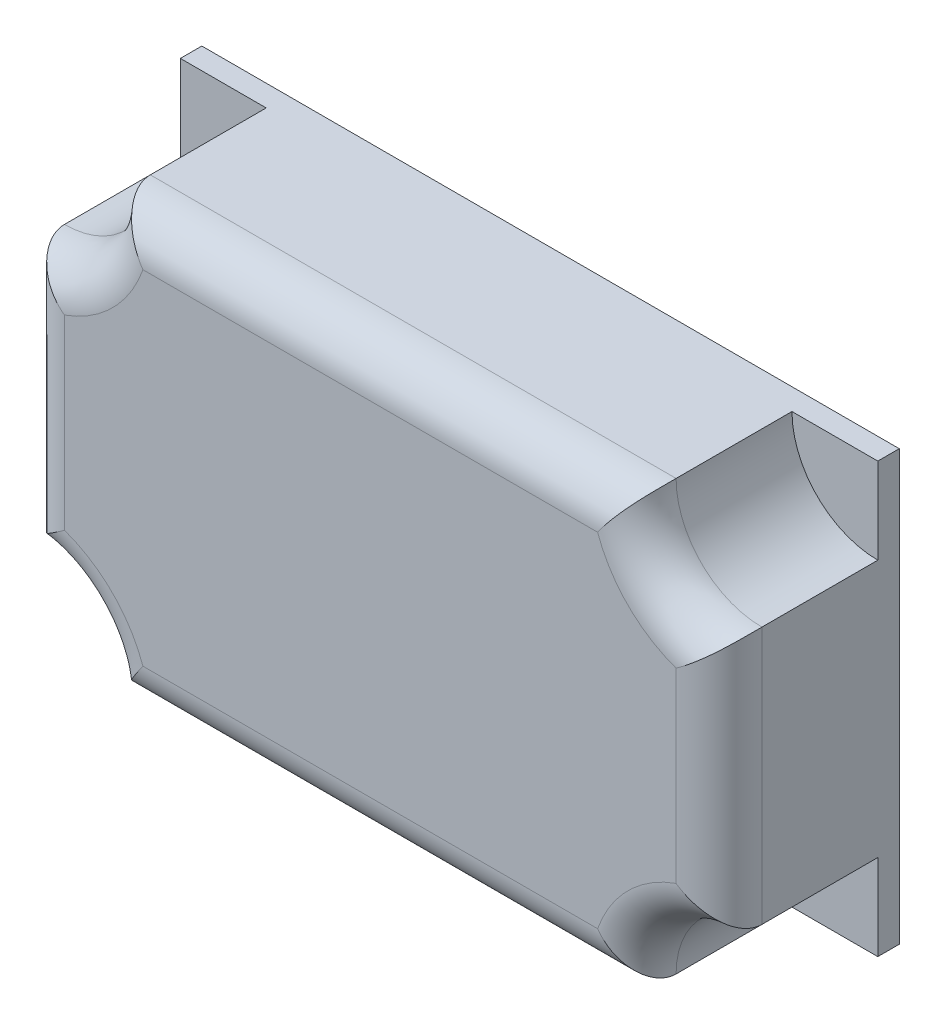
ISO-10303-21;
HEADER;
FILE_DESCRIPTION(('STEP AP214'),'2;1');
FILE_NAME('part.step','',(''),(''),'','','');
FILE_SCHEMA(('AUTOMOTIVE_DESIGN { 1 0 10303 214 1 1 1 1 }'));
ENDSEC;
DATA;
#1=APPLICATION_CONTEXT('core data for automotive mechanical design processes');
#2=APPLICATION_PROTOCOL_DEFINITION('international standard','automotive_design',2000,#1);
#3=PRODUCT_CONTEXT('',#1,'mechanical');
#4=PRODUCT('Part','Part','',(#3));
#5=PRODUCT_RELATED_PRODUCT_CATEGORY('part','',(#4));
#6=PRODUCT_DEFINITION_FORMATION('','',#4);
#7=PRODUCT_DEFINITION_CONTEXT('part definition',#1,'design');
#8=PRODUCT_DEFINITION('design','',#6,#7);
#9=PRODUCT_DEFINITION_SHAPE('','',#8);
#10=(LENGTH_UNIT() NAMED_UNIT(*) SI_UNIT(.MILLI.,.METRE.));
#11=(NAMED_UNIT(*) PLANE_ANGLE_UNIT() SI_UNIT($,.RADIAN.));
#12=(NAMED_UNIT(*) SI_UNIT($,.STERADIAN.) SOLID_ANGLE_UNIT());
#13=UNCERTAINTY_MEASURE_WITH_UNIT(LENGTH_MEASURE(1.E-05),#10,'distance_accuracy_value','');
#14=(GEOMETRIC_REPRESENTATION_CONTEXT(3) GLOBAL_UNCERTAINTY_ASSIGNED_CONTEXT((#13)) GLOBAL_UNIT_ASSIGNED_CONTEXT((#10,
#11,#12)) REPRESENTATION_CONTEXT('',''));
#15=CARTESIAN_POINT('',(0.,0.,0.));
#16=DIRECTION('',(0.,0.,1.));
#17=DIRECTION('',(1.,0.,0.));
#18=AXIS2_PLACEMENT_3D('',#15,#16,#17);
#19=CARTESIAN_POINT('',(27.841647561072,-18.1952723535457,14.8));
#20=DIRECTION('',(0.,0.,-1.));
#21=DIRECTION('',(-1.,0.,0.));
#22=AXIS2_PLACEMENT_3D('',#19,#20,#21);
#23=CYLINDRICAL_SURFACE('',#22,8.);
#24=DIRECTION('',(0.,0.,-1.));
#25=VECTOR('',#24,1.);
#26=CARTESIAN_POINT('',(27.841647561072,-10.1952723535457,14.8));
#27=LINE('',#26,#25);
#28=CARTESIAN_POINT('',(27.841647561072,-10.1952723535457,10.8));
#29=VERTEX_POINT('',#28);
#30=CARTESIAN_POINT('',(27.841647561072,-10.1952723535457,0.));
#31=VERTEX_POINT('',#30);
#32=EDGE_CURVE('E236',#29,#31,#27,.T.);
#33=ORIENTED_EDGE('',*,*,#32,.F.);
#34=CARTESIAN_POINT('',(27.841647561072,-18.1952723535457,10.8));
#35=DIRECTION('',(0.,0.,1.));
#36=DIRECTION('',(1.,0.,0.));
#37=AXIS2_PLACEMENT_3D('',#34,#35,#36);
#38=CIRCLE('',#37,8.);
#39=CARTESIAN_POINT('',(19.841647561072,-18.1952723535457,10.8));
#40=VERTEX_POINT('',#39);
#41=EDGE_CURVE('E11',#29,#40,#38,.T.);
#42=ORIENTED_EDGE('',*,*,#41,.T.);
#43=DIRECTION('',(0.,0.,-1.));
#44=VECTOR('',#43,1.);
#45=CARTESIAN_POINT('',(19.841647561072,-18.1952723535457,14.8));
#46=LINE('',#45,#44);
#47=CARTESIAN_POINT('',(19.841647561072,-18.1952723535457,0.));
#48=VERTEX_POINT('',#47);
#49=EDGE_CURVE('E222',#40,#48,#46,.T.);
#50=ORIENTED_EDGE('',*,*,#49,.T.);
#51=CARTESIAN_POINT('',(27.841647561072,-18.1952723535457,0.));
#52=DIRECTION('',(0.,0.,1.));
#53=DIRECTION('',(1.,0.,0.));
#54=AXIS2_PLACEMENT_3D('',#51,#52,#53);
#55=CIRCLE('',#54,8.);
#56=EDGE_CURVE('E206',#31,#48,#55,.T.);
#57=ORIENTED_EDGE('',*,*,#56,.F.);
#58=EDGE_LOOP('',(#33,#42,#50,#57));
#59=FACE_BOUND('',#58,.T.);
#60=ADVANCED_FACE('F38',(#59),#23,.F.);
#61=CARTESIAN_POINT('',(27.841647561072,0.,14.8));
#62=DIRECTION('',(-1.,0.,0.));
#63=DIRECTION('',(0.,0.,1.));
#64=AXIS2_PLACEMENT_3D('',#61,#62,#63);
#65=PLANE('',#64);
#66=DIRECTION('',(0.,0.,-1.));
#67=VECTOR('',#66,1.);
#68=CARTESIAN_POINT('',(27.841647561072,13.8047276464543,14.8));
#69=LINE('',#68,#67);
#70=CARTESIAN_POINT('',(27.841647561072,13.8047276464543,10.8));
#71=VERTEX_POINT('',#70);
#72=CARTESIAN_POINT('',(27.841647561072,13.8047276464543,0.));
#73=VERTEX_POINT('',#72);
#74=EDGE_CURVE('E234',#71,#73,#69,.T.);
#75=ORIENTED_EDGE('',*,*,#74,.F.);
#76=DIRECTION('',(0.,1.,0.));
#77=VECTOR('',#76,1.);
#78=CARTESIAN_POINT('',(27.841647561072,-10.1952723535457,10.8));
#79=LINE('',#78,#77);
#80=EDGE_CURVE('E52',#71,#29,#79,.F.);
#81=ORIENTED_EDGE('',*,*,#80,.T.);
#82=ORIENTED_EDGE('',*,*,#32,.T.);
#83=DIRECTION('',(0.,1.,0.));
#84=VECTOR('',#83,1.);
#85=CARTESIAN_POINT('',(27.841647561072,0.,0.));
#86=LINE('',#85,#84);
#87=CARTESIAN_POINT('',(27.841647561072,-18.1952723535457,0.));
#88=VERTEX_POINT('',#87);
#89=EDGE_CURVE('E187',#88,#31,#86,.T.);
#90=ORIENTED_EDGE('',*,*,#89,.F.);
#91=DIRECTION('',(0.,0.,1.));
#92=VECTOR('',#91,1.);
#93=CARTESIAN_POINT('',(27.841647561072,-18.1952723535457,-2.));
#94=LINE('',#93,#92);
#95=CARTESIAN_POINT('',(27.841647561072,-18.1952723535457,-2.));
#96=VERTEX_POINT('',#95);
#97=EDGE_CURVE('E207',#96,#88,#94,.T.);
#98=ORIENTED_EDGE('',*,*,#97,.F.);
#99=DIRECTION('',(0.,1.,0.));
#100=VECTOR('',#99,1.);
#101=CARTESIAN_POINT('',(27.841647561072,0.,-2.));
#102=LINE('',#101,#100);
#103=CARTESIAN_POINT('',(27.841647561072,21.8047276464543,-2.));
#104=VERTEX_POINT('',#103);
#105=EDGE_CURVE('E170',#96,#104,#102,.T.);
#106=ORIENTED_EDGE('',*,*,#105,.T.);
#107=DIRECTION('',(0.,0.,1.));
#108=VECTOR('',#107,1.);
#109=CARTESIAN_POINT('',(27.841647561072,21.8047276464543,-2.));
#110=LINE('',#109,#108);
#111=CARTESIAN_POINT('',(27.841647561072,21.8047276464543,0.));
#112=VERTEX_POINT('',#111);
#113=EDGE_CURVE('E186',#104,#112,#110,.T.);
#114=ORIENTED_EDGE('',*,*,#113,.T.);
#115=EDGE_CURVE('E190',#73,#112,#86,.T.);
#116=ORIENTED_EDGE('',*,*,#115,.F.);
#117=EDGE_LOOP('',(#75,#81,#82,#90,#98,#106,#114,#116));
#118=FACE_BOUND('',#117,.T.);
#119=ADVANCED_FACE('F390',(#118),#65,.F.);
#120=CARTESIAN_POINT('',(27.841647561072,21.8047276464543,14.8));
#121=DIRECTION('',(0.,0.,-1.));
#122=DIRECTION('',(-1.,0.,0.));
#123=AXIS2_PLACEMENT_3D('',#120,#121,#122);
#124=CYLINDRICAL_SURFACE('',#123,8.);
#125=DIRECTION('',(0.,0.,-1.));
#126=VECTOR('',#125,1.);
#127=CARTESIAN_POINT('',(19.841647561072,21.8047276464543,14.8));
#128=LINE('',#127,#126);
#129=CARTESIAN_POINT('',(19.841647561072,21.8047276464543,10.8));
#130=VERTEX_POINT('',#129);
#131=CARTESIAN_POINT('',(19.841647561072,21.8047276464543,0.));
#132=VERTEX_POINT('',#131);
#133=EDGE_CURVE('E232',#130,#132,#128,.T.);
#134=ORIENTED_EDGE('',*,*,#133,.F.);
#135=CARTESIAN_POINT('',(27.841647561072,21.8047276464543,10.8));
#136=DIRECTION('',(0.,0.,1.));
#137=DIRECTION('',(1.,0.,0.));
#138=AXIS2_PLACEMENT_3D('',#135,#136,#137);
#139=CIRCLE('',#138,8.);
#140=EDGE_CURVE('E67',#130,#71,#139,.T.);
#141=ORIENTED_EDGE('',*,*,#140,.T.);
#142=ORIENTED_EDGE('',*,*,#74,.T.);
#143=CARTESIAN_POINT('',(27.841647561072,21.8047276464543,0.));
#144=DIRECTION('',(0.,0.,1.));
#145=DIRECTION('',(1.,0.,0.));
#146=AXIS2_PLACEMENT_3D('',#143,#144,#145);
#147=CIRCLE('',#146,8.);
#148=EDGE_CURVE('E213',#73,#132,#147,.F.);
#149=ORIENTED_EDGE('',*,*,#148,.T.);
#150=EDGE_LOOP('',(#134,#141,#142,#149));
#151=FACE_BOUND('',#150,.T.);
#152=ADVANCED_FACE('F412',(#151),#124,.F.);
#153=CARTESIAN_POINT('',(0.,21.8047276464543,14.8));
#154=DIRECTION('',(0.,-1.,0.));
#155=DIRECTION('',(1.,0.,0.));
#156=AXIS2_PLACEMENT_3D('',#153,#154,#155);
#157=PLANE('',#156);
#158=DIRECTION('',(0.,0.,-1.));
#159=VECTOR('',#158,1.);
#160=CARTESIAN_POINT('',(-29.158352438928,21.8047276464543,14.8));
#161=LINE('',#160,#159);
#162=CARTESIAN_POINT('',(-29.158352438928,21.8047276464543,10.8));
#163=VERTEX_POINT('',#162);
#164=CARTESIAN_POINT('',(-29.158352438928,21.8047276464543,0.));
#165=VERTEX_POINT('',#164);
#166=EDGE_CURVE('E230',#163,#165,#161,.T.);
#167=ORIENTED_EDGE('',*,*,#166,.F.);
#168=DIRECTION('',(-1.,0.,0.));
#169=VECTOR('',#168,1.);
#170=CARTESIAN_POINT('',(19.841647561072,21.8047276464543,10.8));
#171=LINE('',#170,#169);
#172=EDGE_CURVE('E264',#163,#130,#171,.F.);
#173=ORIENTED_EDGE('',*,*,#172,.T.);
#174=ORIENTED_EDGE('',*,*,#133,.T.);
#175=DIRECTION('',(-1.,0.,0.));
#176=VECTOR('',#175,1.);
#177=CARTESIAN_POINT('',(0.,21.8047276464543,0.));
#178=LINE('',#177,#176);
#179=EDGE_CURVE('E195',#112,#132,#178,.T.);
#180=ORIENTED_EDGE('',*,*,#179,.F.);
#181=ORIENTED_EDGE('',*,*,#113,.F.);
#182=DIRECTION('',(-1.,0.,0.));
#183=VECTOR('',#182,1.);
#184=CARTESIAN_POINT('',(0.,21.8047276464543,-2.));
#185=LINE('',#184,#183);
#186=CARTESIAN_POINT('',(-37.158352438928,21.8047276464543,-2.));
#187=VERTEX_POINT('',#186);
#188=EDGE_CURVE('E177',#104,#187,#185,.T.);
#189=ORIENTED_EDGE('',*,*,#188,.T.);
#190=DIRECTION('',(0.,0.,1.));
#191=VECTOR('',#190,1.);
#192=CARTESIAN_POINT('',(-37.158352438928,21.8047276464543,-2.));
#193=LINE('',#192,#191);
#194=CARTESIAN_POINT('',(-37.158352438928,21.8047276464543,0.));
#195=VERTEX_POINT('',#194);
#196=EDGE_CURVE('E158',#187,#195,#193,.T.);
#197=ORIENTED_EDGE('',*,*,#196,.T.);
#198=EDGE_CURVE('E199',#165,#195,#178,.T.);
#199=ORIENTED_EDGE('',*,*,#198,.F.);
#200=EDGE_LOOP('',(#167,#173,#174,#180,#181,#189,#197,#199));
#201=FACE_BOUND('',#200,.T.);
#202=ADVANCED_FACE('F183',(#201),#157,.F.);
#203=CARTESIAN_POINT('',(-37.158352438928,21.8047276464543,14.8));
#204=DIRECTION('',(0.,0.,-1.));
#205=DIRECTION('',(-1.,0.,0.));
#206=AXIS2_PLACEMENT_3D('',#203,#204,#205);
#207=CYLINDRICAL_SURFACE('',#206,8.);
#208=DIRECTION('',(0.,0.,-1.));
#209=VECTOR('',#208,1.);
#210=CARTESIAN_POINT('',(-37.158352438928,13.8047276464543,14.8));
#211=LINE('',#210,#209);
#212=CARTESIAN_POINT('',(-37.158352438928,13.8047276464543,10.8));
#213=VERTEX_POINT('',#212);
#214=CARTESIAN_POINT('',(-37.158352438928,13.8047276464543,0.));
#215=VERTEX_POINT('',#214);
#216=EDGE_CURVE('E228',#213,#215,#211,.T.);
#217=ORIENTED_EDGE('',*,*,#216,.F.);
#218=CARTESIAN_POINT('',(-37.158352438928,21.8047276464543,10.8));
#219=DIRECTION('',(0.,0.,1.));
#220=DIRECTION('',(1.,0.,0.));
#221=AXIS2_PLACEMENT_3D('',#218,#219,#220);
#222=CIRCLE('',#221,8.);
#223=EDGE_CURVE('E262',#213,#163,#222,.T.);
#224=ORIENTED_EDGE('',*,*,#223,.T.);
#225=ORIENTED_EDGE('',*,*,#166,.T.);
#226=CARTESIAN_POINT('',(-37.158352438928,21.8047276464543,0.));
#227=DIRECTION('',(0.,0.,1.));
#228=DIRECTION('',(1.,0.,0.));
#229=AXIS2_PLACEMENT_3D('',#226,#227,#228);
#230=CIRCLE('',#229,8.);
#231=EDGE_CURVE('E216',#165,#215,#230,.F.);
#232=ORIENTED_EDGE('',*,*,#231,.T.);
#233=EDGE_LOOP('',(#217,#224,#225,#232));
#234=FACE_BOUND('',#233,.T.);
#235=ADVANCED_FACE('F357',(#234),#207,.F.);
#236=CARTESIAN_POINT('',(-37.158352438928,0.,14.8));
#237=DIRECTION('',(1.,0.,0.));
#238=DIRECTION('',(0.,1.,0.));
#239=AXIS2_PLACEMENT_3D('',#236,#237,#238);
#240=PLANE('',#239);
#241=DIRECTION('',(0.,0.,-1.));
#242=VECTOR('',#241,1.);
#243=CARTESIAN_POINT('',(-37.158352438928,-10.1952723535457,14.8));
#244=LINE('',#243,#242);
#245=CARTESIAN_POINT('',(-37.158352438928,-10.1952723535457,10.8));
#246=VERTEX_POINT('',#245);
#247=CARTESIAN_POINT('',(-37.158352438928,-10.1952723535457,0.));
#248=VERTEX_POINT('',#247);
#249=EDGE_CURVE('E226',#246,#248,#244,.T.);
#250=ORIENTED_EDGE('',*,*,#249,.F.);
#251=DIRECTION('',(0.,-1.,0.));
#252=VECTOR('',#251,1.);
#253=CARTESIAN_POINT('',(-37.158352438928,13.8047276464543,10.8));
#254=LINE('',#253,#252);
#255=EDGE_CURVE('E260',#246,#213,#254,.F.);
#256=ORIENTED_EDGE('',*,*,#255,.T.);
#257=ORIENTED_EDGE('',*,*,#216,.T.);
#258=DIRECTION('',(0.,-1.,0.));
#259=VECTOR('',#258,1.);
#260=CARTESIAN_POINT('',(-37.158352438928,0.,0.));
#261=LINE('',#260,#259);
#262=EDGE_CURVE('E165',#195,#215,#261,.T.);
#263=ORIENTED_EDGE('',*,*,#262,.F.);
#264=ORIENTED_EDGE('',*,*,#196,.F.);
#265=DIRECTION('',(0.,-1.,0.));
#266=VECTOR('',#265,1.);
#267=CARTESIAN_POINT('',(-37.158352438928,0.,-2.));
#268=LINE('',#267,#266);
#269=CARTESIAN_POINT('',(-37.158352438928,-18.1952723535457,-2.));
#270=VERTEX_POINT('',#269);
#271=EDGE_CURVE('E163',#187,#270,#268,.T.);
#272=ORIENTED_EDGE('',*,*,#271,.T.);
#273=DIRECTION('',(0.,0.,1.));
#274=VECTOR('',#273,1.);
#275=CARTESIAN_POINT('',(-37.158352438928,-18.1952723535457,-2.));
#276=LINE('',#275,#274);
#277=CARTESIAN_POINT('',(-37.158352438928,-18.1952723535457,0.));
#278=VERTEX_POINT('',#277);
#279=EDGE_CURVE('E169',#270,#278,#276,.T.);
#280=ORIENTED_EDGE('',*,*,#279,.T.);
#281=EDGE_CURVE('E198',#248,#278,#261,.T.);
#282=ORIENTED_EDGE('',*,*,#281,.F.);
#283=EDGE_LOOP('',(#250,#256,#257,#263,#264,#272,#280,#282));
#284=FACE_BOUND('',#283,.T.);
#285=ADVANCED_FACE('F161',(#284),#240,.F.);
#286=CARTESIAN_POINT('',(-37.158352438928,-18.1952723535457,14.8));
#287=DIRECTION('',(0.,0.,-1.));
#288=DIRECTION('',(-1.,0.,0.));
#289=AXIS2_PLACEMENT_3D('',#286,#287,#288);
#290=CYLINDRICAL_SURFACE('',#289,8.);
#291=DIRECTION('',(0.,0.,-1.));
#292=VECTOR('',#291,1.);
#293=CARTESIAN_POINT('',(-29.158352438928,-18.1952723535457,14.8));
#294=LINE('',#293,#292);
#295=CARTESIAN_POINT('',(-29.158352438928,-18.1952723535457,10.8));
#296=VERTEX_POINT('',#295);
#297=CARTESIAN_POINT('',(-29.158352438928,-18.1952723535457,0.));
#298=VERTEX_POINT('',#297);
#299=EDGE_CURVE('E224',#296,#298,#294,.T.);
#300=ORIENTED_EDGE('',*,*,#299,.F.);
#301=CARTESIAN_POINT('',(-37.158352438928,-18.1952723535457,10.8));
#302=DIRECTION('',(0.,0.,1.));
#303=DIRECTION('',(1.,0.,0.));
#304=AXIS2_PLACEMENT_3D('',#301,#302,#303);
#305=CIRCLE('',#304,8.);
#306=EDGE_CURVE('E258',#296,#246,#305,.T.);
#307=ORIENTED_EDGE('',*,*,#306,.T.);
#308=ORIENTED_EDGE('',*,*,#249,.T.);
#309=CARTESIAN_POINT('',(-37.158352438928,-18.1952723535457,0.));
#310=DIRECTION('',(0.,0.,1.));
#311=DIRECTION('',(1.,0.,0.));
#312=AXIS2_PLACEMENT_3D('',#309,#310,#311);
#313=CIRCLE('',#312,8.);
#314=EDGE_CURVE('E219',#298,#248,#313,.T.);
#315=ORIENTED_EDGE('',*,*,#314,.F.);
#316=EDGE_LOOP('',(#300,#307,#308,#315));
#317=FACE_BOUND('',#316,.T.);
#318=ADVANCED_FACE('F383',(#317),#290,.F.);
#319=CARTESIAN_POINT('',(0.,-18.1952723535457,14.8));
#320=DIRECTION('',(0.,1.,0.));
#321=DIRECTION('',(0.,0.,1.));
#322=AXIS2_PLACEMENT_3D('',#319,#320,#321);
#323=PLANE('',#322);
#324=ORIENTED_EDGE('',*,*,#49,.F.);
#325=DIRECTION('',(1.,0.,0.));
#326=VECTOR('',#325,1.);
#327=CARTESIAN_POINT('',(-29.158352438928,-18.1952723535457,10.8));
#328=LINE('',#327,#326);
#329=EDGE_CURVE('E255',#40,#296,#328,.F.);
#330=ORIENTED_EDGE('',*,*,#329,.T.);
#331=ORIENTED_EDGE('',*,*,#299,.T.);
#332=DIRECTION('',(1.,0.,0.));
#333=VECTOR('',#332,1.);
#334=CARTESIAN_POINT('',(0.,-18.1952723535457,0.));
#335=LINE('',#334,#333);
#336=EDGE_CURVE('E202',#278,#298,#335,.T.);
#337=ORIENTED_EDGE('',*,*,#336,.F.);
#338=ORIENTED_EDGE('',*,*,#279,.F.);
#339=DIRECTION('',(1.,0.,0.));
#340=VECTOR('',#339,1.);
#341=CARTESIAN_POINT('',(0.,-18.1952723535457,-2.));
#342=LINE('',#341,#340);
#343=EDGE_CURVE('E180',#270,#96,#342,.T.);
#344=ORIENTED_EDGE('',*,*,#343,.T.);
#345=ORIENTED_EDGE('',*,*,#97,.T.);
#346=EDGE_CURVE('E201',#48,#88,#335,.T.);
#347=ORIENTED_EDGE('',*,*,#346,.F.);
#348=EDGE_LOOP('',(#324,#330,#331,#337,#338,#344,#345,#347));
#349=FACE_BOUND('',#348,.T.);
#350=ADVANCED_FACE('F374',(#349),#323,.F.);
#351=CARTESIAN_POINT('',(0.,0.,14.8));
#352=DIRECTION('',(0.,0.,1.));
#353=DIRECTION('',(1.,0.,0.));
#354=AXIS2_PLACEMENT_3D('',#351,#352,#353);
#355=PLANE('',#354);
#356=CARTESIAN_POINT('',(-37.158352438928,-18.1952723535457,14.8));
#357=DIRECTION('',(0.,0.,1.));
#358=DIRECTION('',(1.,0.,0.));
#359=AXIS2_PLACEMENT_3D('',#356,#357,#358);
#360=CIRCLE('',#359,12.);
#361=CARTESIAN_POINT('',(-33.158352438928,-6.88156385456097,14.8));
#362=VERTEX_POINT('',#361);
#363=CARTESIAN_POINT('',(-25.8446439399432,-14.1952723535457,14.8));
#364=VERTEX_POINT('',#363);
#365=EDGE_CURVE('E250',#362,#364,#360,.F.);
#366=ORIENTED_EDGE('',*,*,#365,.T.);
#367=DIRECTION('',(1.,0.,0.));
#368=VECTOR('',#367,1.);
#369=CARTESIAN_POINT('',(19.841647561072,-14.1952723535457,14.8));
#370=LINE('',#369,#368);
#371=CARTESIAN_POINT('',(16.5279390620873,-14.1952723535457,14.8));
#372=VERTEX_POINT('',#371);
#373=EDGE_CURVE('E252',#364,#372,#370,.T.);
#374=ORIENTED_EDGE('',*,*,#373,.T.);
#375=CARTESIAN_POINT('',(27.841647561072,-18.1952723535457,14.8));
#376=DIRECTION('',(0.,0.,1.));
#377=DIRECTION('',(1.,0.,0.));
#378=AXIS2_PLACEMENT_3D('',#375,#376,#377);
#379=CIRCLE('',#378,12.);
#380=CARTESIAN_POINT('',(23.841647561072,-6.88156385456097,14.8));
#381=VERTEX_POINT('',#380);
#382=EDGE_CURVE('E238',#372,#381,#379,.F.);
#383=ORIENTED_EDGE('',*,*,#382,.T.);
#384=DIRECTION('',(0.,1.,0.));
#385=VECTOR('',#384,1.);
#386=CARTESIAN_POINT('',(23.841647561072,13.8047276464543,14.8));
#387=LINE('',#386,#385);
#388=CARTESIAN_POINT('',(23.841647561072,10.4910191474695,14.8));
#389=VERTEX_POINT('',#388);
#390=EDGE_CURVE('E240',#381,#389,#387,.T.);
#391=ORIENTED_EDGE('',*,*,#390,.T.);
#392=CARTESIAN_POINT('',(27.841647561072,21.8047276464543,14.8));
#393=DIRECTION('',(0.,0.,1.));
#394=DIRECTION('',(1.,0.,0.));
#395=AXIS2_PLACEMENT_3D('',#392,#393,#394);
#396=CIRCLE('',#395,12.);
#397=CARTESIAN_POINT('',(16.5279390620873,17.8047276464543,14.8));
#398=VERTEX_POINT('',#397);
#399=EDGE_CURVE('E242',#389,#398,#396,.F.);
#400=ORIENTED_EDGE('',*,*,#399,.T.);
#401=DIRECTION('',(-1.,0.,0.));
#402=VECTOR('',#401,1.);
#403=CARTESIAN_POINT('',(-29.158352438928,17.8047276464543,14.8));
#404=LINE('',#403,#402);
#405=CARTESIAN_POINT('',(-25.8446439399432,17.8047276464543,14.8));
#406=VERTEX_POINT('',#405);
#407=EDGE_CURVE('E244',#398,#406,#404,.T.);
#408=ORIENTED_EDGE('',*,*,#407,.T.);
#409=CARTESIAN_POINT('',(-37.158352438928,21.8047276464543,14.8));
#410=DIRECTION('',(0.,0.,1.));
#411=DIRECTION('',(1.,0.,0.));
#412=AXIS2_PLACEMENT_3D('',#409,#410,#411);
#413=CIRCLE('',#412,12.);
#414=CARTESIAN_POINT('',(-33.158352438928,10.4910191474695,14.8));
#415=VERTEX_POINT('',#414);
#416=EDGE_CURVE('E246',#406,#415,#413,.F.);
#417=ORIENTED_EDGE('',*,*,#416,.T.);
#418=DIRECTION('',(0.,-1.,0.));
#419=VECTOR('',#418,1.);
#420=CARTESIAN_POINT('',(-33.158352438928,-10.1952723535457,14.8));
#421=LINE('',#420,#419);
#422=EDGE_CURVE('E248',#415,#362,#421,.T.);
#423=ORIENTED_EDGE('',*,*,#422,.T.);
#424=EDGE_LOOP('',(#366,#374,#383,#391,#400,#408,#417,#423));
#425=FACE_BOUND('',#424,.T.);
#426=ADVANCED_FACE('F396',(#425),#355,.T.);
#427=CARTESIAN_POINT('',(0.,0.,0.));
#428=DIRECTION('',(0.,0.,1.));
#429=DIRECTION('',(1.,0.,0.));
#430=AXIS2_PLACEMENT_3D('',#427,#428,#429);
#431=PLANE('',#430);
#432=ORIENTED_EDGE('',*,*,#89,.T.);
#433=ORIENTED_EDGE('',*,*,#56,.T.);
#434=ORIENTED_EDGE('',*,*,#346,.T.);
#435=EDGE_LOOP('',(#432,#433,#434));
#436=FACE_BOUND('',#435,.T.);
#437=ADVANCED_FACE('F393',(#436),#431,.T.);
#438=ORIENTED_EDGE('',*,*,#231,.F.);
#439=ORIENTED_EDGE('',*,*,#198,.T.);
#440=ORIENTED_EDGE('',*,*,#262,.T.);
#441=EDGE_LOOP('',(#438,#439,#440));
#442=FACE_BOUND('',#441,.T.);
#443=ADVANCED_FACE('F395',(#442),#431,.T.);
#444=ORIENTED_EDGE('',*,*,#148,.F.);
#445=ORIENTED_EDGE('',*,*,#115,.T.);
#446=ORIENTED_EDGE('',*,*,#179,.T.);
#447=EDGE_LOOP('',(#444,#445,#446));
#448=FACE_BOUND('',#447,.T.);
#449=ADVANCED_FACE('F402',(#448),#431,.T.);
#450=CARTESIAN_POINT('',(0.,0.,-2.));
#451=DIRECTION('',(0.,0.,1.));
#452=DIRECTION('',(1.,0.,0.));
#453=AXIS2_PLACEMENT_3D('',#450,#451,#452);
#454=PLANE('',#453);
#455=ORIENTED_EDGE('',*,*,#188,.F.);
#456=ORIENTED_EDGE('',*,*,#105,.F.);
#457=ORIENTED_EDGE('',*,*,#343,.F.);
#458=ORIENTED_EDGE('',*,*,#271,.F.);
#459=EDGE_LOOP('',(#455,#456,#457,#458));
#460=FACE_BOUND('',#459,.T.);
#461=ADVANCED_FACE('F175',(#460),#454,.F.);
#462=ORIENTED_EDGE('',*,*,#336,.T.);
#463=ORIENTED_EDGE('',*,*,#314,.T.);
#464=ORIENTED_EDGE('',*,*,#281,.T.);
#465=EDGE_LOOP('',(#462,#463,#464));
#466=FACE_BOUND('',#465,.T.);
#467=ADVANCED_FACE('F388',(#466),#431,.T.);
#468=CARTESIAN_POINT('',(0.,17.8047276464543,10.8));
#469=DIRECTION('',(1.,0.,0.));
#470=DIRECTION('',(0.,1.,0.));
#471=AXIS2_PLACEMENT_3D('',#468,#469,#470);
#472=CYLINDRICAL_SURFACE('',#471,4.);
#473=CARTESIAN_POINT('',(19.841647561072,21.8047276464543,10.8));
#474=CARTESIAN_POINT('',(19.8416787952042,21.8047514961402,10.8914934993086));
#475=CARTESIAN_POINT('',(19.838509432998,21.8015893912396,10.9829647658696));
#476=CARTESIAN_POINT('',(19.8260100217386,21.7890792159011,11.1649714910398));
#477=CARTESIAN_POINT('',(19.8166860691746,21.7797372669478,11.2555077857505));
#478=CARTESIAN_POINT('',(19.7922352307469,21.7551713518686,11.4340747496616));
#479=CARTESIAN_POINT('',(19.7771650035619,21.7400048064962,11.5221211407223));
#480=CARTESIAN_POINT('',(19.7416324111215,21.7041071700911,11.6959501350899));
#481=CARTESIAN_POINT('',(19.7211689925268,21.6833749920249,11.7817322925669));
#482=CARTESIAN_POINT('',(19.6525696522514,21.6135452011767,12.0341984802864));
#483=CARTESIAN_POINT('',(19.5971025314228,21.5566936933886,12.1968422515119));
#484=CARTESIAN_POINT('',(19.4706823054757,21.4254121626181,12.5086407289788));
#485=CARTESIAN_POINT('',(19.3996865841182,21.3509337177011,12.6577566844522));
#486=CARTESIAN_POINT('',(19.2120710937935,21.1511364014836,13.0038991698077));
#487=CARTESIAN_POINT('',(19.0891495087073,21.0178912228349,13.1929996640717));
#488=CARTESIAN_POINT('',(18.8933958483264,20.8005492087262,13.4529005895834));
#489=CARTESIAN_POINT('',(18.8261525177818,20.7250775974947,13.5356699987146));
#490=CARTESIAN_POINT('',(18.688621743886,20.5689042502453,13.6933759113023));
#491=CARTESIAN_POINT('',(18.6183351401994,20.4882039538534,13.7683145560989));
#492=CARTESIAN_POINT('',(18.4570137157119,20.3007723100061,13.928681085382));
#493=CARTESIAN_POINT('',(18.3652955282125,20.1926877531478,14.0118431261191));
#494=CARTESIAN_POINT('',(18.179285807461,19.9701936217726,14.1658700726018));
#495=CARTESIAN_POINT('',(18.0849935401128,19.8557822331744,14.2367314270338));
#496=CARTESIAN_POINT('',(17.7996873879149,19.5044126709119,14.4307831587096));
#497=CARTESIAN_POINT('',(17.6060500418237,19.2590945579986,14.5356301915175));
#498=CARTESIAN_POINT('',(17.2649398500208,18.8144232692401,14.6757042766999));
#499=CARTESIAN_POINT('',(17.1175592392476,18.6181967585023,14.7216084149863));
#500=CARTESIAN_POINT('',(16.824617415937,18.2201262919395,14.7834459558905));
#501=CARTESIAN_POINT('',(16.6790528801046,18.018295832944,14.7994459379784));
#502=CARTESIAN_POINT('',(16.5329537067434,17.8118182545889,14.7999952922833));
#503=CARTESIAN_POINT('',(16.530446080038,17.8082731135911,14.8000000063146));
#504=CARTESIAN_POINT('',(16.5279390620873,17.8047276464543,14.8));
#505=B_SPLINE_CURVE_WITH_KNOTS('',3,(#473,#474,#475,#476,#477,#478,#479,#480,#481,#482,#483,
#484,#485,#486,#487,#488,#489,#490,#491,#492,#493,#494,#495,#496,#497,#498,#499,#500,#501,#502,
#503,#504),.UNSPECIFIED.,.F.,.F.,(4,2,2,2,2,2,2,2,2,2,2,2,2,2,2,4),(0.,0.274334999297623,
0.548398660375553,0.819827130991669,1.09130865339087,1.63173386066723,2.1736612319215,
2.95493062939673,3.3466070822919,3.73817614854472,4.23054529764756,4.72305636237498,
5.70703552345836,6.45447740820184,7.20025317537054,7.21328029445401),.UNSPECIFIED.);
#506=EDGE_CURVE('E335',#130,#398,#505,.T.);
#507=ORIENTED_EDGE('',*,*,#506,.F.);
#508=ORIENTED_EDGE('',*,*,#172,.F.);
#509=CARTESIAN_POINT('',(-29.158352438928,21.8047276464543,10.8));
#510=CARTESIAN_POINT('',(-29.1583836730601,21.8047514961402,10.8914934993086));
#511=CARTESIAN_POINT('',(-29.1552143108539,21.8015893912396,10.9829647658696));
#512=CARTESIAN_POINT('',(-29.1427148995945,21.7890792159011,11.1649714910398));
#513=CARTESIAN_POINT('',(-29.1333909470306,21.7797372669478,11.2555077857505));
#514=CARTESIAN_POINT('',(-29.1089401086029,21.7551713518685,11.4340747496616));
#515=CARTESIAN_POINT('',(-29.0938698814179,21.7400048064962,11.5221211407223));
#516=CARTESIAN_POINT('',(-29.0583372889775,21.7041071700911,11.6959501350899));
#517=CARTESIAN_POINT('',(-29.0378738703827,21.6833749920249,11.7817322925669));
#518=CARTESIAN_POINT('',(-28.9692745301073,21.6135452011767,12.0341984802864));
#519=CARTESIAN_POINT('',(-28.9138074092788,21.5566936933886,12.1968422515119));
#520=CARTESIAN_POINT('',(-28.7873871833317,21.425412162618,12.5086407289788));
#521=CARTESIAN_POINT('',(-28.7163914619741,21.3509337177011,12.6577566844522));
#522=CARTESIAN_POINT('',(-28.5287759716495,21.1511364014836,13.0038991698077));
#523=CARTESIAN_POINT('',(-28.4058543865632,21.0178912228349,13.1929996640717));
#524=CARTESIAN_POINT('',(-28.2101007261824,20.8005492087262,13.4529005895834));
#525=CARTESIAN_POINT('',(-28.1428573956378,20.7250775974947,13.5356699987145));
#526=CARTESIAN_POINT('',(-28.005326621742,20.5689042502453,13.6933759113023));
#527=CARTESIAN_POINT('',(-27.9350400180553,20.4882039538534,13.7683145560989));
#528=CARTESIAN_POINT('',(-27.7737185935679,20.3007723100061,13.928681085382));
#529=CARTESIAN_POINT('',(-27.6820004060685,20.1926877531478,14.0118431261191));
#530=CARTESIAN_POINT('',(-27.495990685317,19.9701936217726,14.1658700726018));
#531=CARTESIAN_POINT('',(-27.4016984179688,19.8557822331744,14.2367314270338));
#532=CARTESIAN_POINT('',(-27.1163922657709,19.5044126709118,14.4307831587096));
#533=CARTESIAN_POINT('',(-26.9227549196797,19.2590945579986,14.5356301915175));
#534=CARTESIAN_POINT('',(-26.5816447278767,18.8144232692401,14.6757042766999));
#535=CARTESIAN_POINT('',(-26.4342641171035,18.6181967585024,14.7216084149863));
#536=CARTESIAN_POINT('',(-26.1413222937931,18.2201262919394,14.7834459558905));
#537=CARTESIAN_POINT('',(-25.9957577579608,18.0182958329439,14.7994459379784));
#538=CARTESIAN_POINT('',(-25.8496585845994,17.8118182545889,14.7999952922833));
#539=CARTESIAN_POINT('',(-25.847150957894,17.8082731135911,14.8000000063146));
#540=CARTESIAN_POINT('',(-25.8446439399432,17.8047276464543,14.8));
#541=B_SPLINE_CURVE_WITH_KNOTS('',3,(#509,#510,#511,#512,#513,#514,#515,#516,#517,#518,#519,
#520,#521,#522,#523,#524,#525,#526,#527,#528,#529,#530,#531,#532,#533,#534,#535,#536,#537,#538,
#539,#540),.UNSPECIFIED.,.F.,.F.,(4,2,2,2,2,2,2,2,2,2,2,2,2,2,2,4),(0.,0.274334999297623,
0.548398660375555,0.819827130991667,1.09130865339087,1.63173386066723,2.1736612319215,
2.95493062939673,3.3466070822919,3.73817614854472,4.23054529764756,4.72305636237499,
5.70703552345836,6.45447740820184,7.20025317537054,7.21328029445401),.UNSPECIFIED.);
#542=EDGE_CURVE('E43',#406,#163,#541,.F.);
#543=ORIENTED_EDGE('',*,*,#542,.F.);
#544=ORIENTED_EDGE('',*,*,#407,.F.);
#545=EDGE_LOOP('',(#507,#508,#543,#544));
#546=FACE_BOUND('',#545,.T.);
#547=ADVANCED_FACE('F40',(#546),#472,.T.);
#548=CARTESIAN_POINT('',(-37.158352438928,21.8047276464543,10.8));
#549=DIRECTION('',(0.,0.,1.));
#550=DIRECTION('',(1.,0.,0.));
#551=AXIS2_PLACEMENT_3D('',#548,#549,#550);
#552=TOROIDAL_SURFACE('',#551,12.,4.);
#553=ORIENTED_EDGE('',*,*,#542,.T.);
#554=ORIENTED_EDGE('',*,*,#223,.F.);
#555=CARTESIAN_POINT('',(-37.158352438928,13.8047276464543,10.8));
#556=CARTESIAN_POINT('',(-37.1583762886139,13.8047588805864,10.8914934993086));
#557=CARTESIAN_POINT('',(-37.1552141837133,13.8015895183802,10.9829647658696));
#558=CARTESIAN_POINT('',(-37.1427040083748,13.7890901071208,11.1649714910398));
#559=CARTESIAN_POINT('',(-37.1333620594215,13.7797661545569,11.2555077857505));
#560=CARTESIAN_POINT('',(-37.1087961443423,13.7553153161292,11.4340747496616));
#561=CARTESIAN_POINT('',(-37.0936295989699,13.7402450889442,11.5221211407223));
#562=CARTESIAN_POINT('',(-37.0577319625648,13.7047124965038,11.6959501350899));
#563=CARTESIAN_POINT('',(-37.0369997844986,13.684249077909,11.7817322925669));
#564=CARTESIAN_POINT('',(-36.9671699936505,13.6156497376336,12.0341984802864));
#565=CARTESIAN_POINT('',(-36.9103184858623,13.5601826168051,12.1968422515119));
#566=CARTESIAN_POINT('',(-36.7790369550918,13.433762390858,12.5086407289788));
#567=CARTESIAN_POINT('',(-36.7045585101748,13.3627666695004,12.6577566844522));
#568=CARTESIAN_POINT('',(-36.5047611939573,13.1751511791757,13.0038991698077));
#569=CARTESIAN_POINT('',(-36.3715160153086,13.0522295940895,13.1929996640717));
#570=CARTESIAN_POINT('',(-36.1541740011999,12.8564759337087,13.4529005895834));
#571=CARTESIAN_POINT('',(-36.0787023899684,12.7892326031641,13.5356699987146));
#572=CARTESIAN_POINT('',(-35.922529042719,12.6517018292683,13.6933759113023));
#573=CARTESIAN_POINT('',(-35.8418287463272,12.5814152255816,13.7683145560989));
#574=CARTESIAN_POINT('',(-35.6543971024798,12.4200938010942,13.928681085382));
#575=CARTESIAN_POINT('',(-35.5463125456215,12.3283756135948,14.0118431261191));
#576=CARTESIAN_POINT('',(-35.3238184142463,12.1423658928433,14.1658700726018));
#577=CARTESIAN_POINT('',(-35.2094070256481,12.048073625495,14.2367314270338));
#578=CARTESIAN_POINT('',(-34.8580374633856,11.7627674732971,14.4307831587096));
#579=CARTESIAN_POINT('',(-34.6127193504723,11.5691301272059,14.5356301915175));
#580=CARTESIAN_POINT('',(-34.1680480617139,11.228019935403,14.6757042766999));
#581=CARTESIAN_POINT('',(-33.9718215509761,11.0806393246298,14.7216084149863));
#582=CARTESIAN_POINT('',(-33.5737510844131,10.7876975013194,14.7834459558905));
#583=CARTESIAN_POINT('',(-33.3719206254176,10.6421329654871,14.7994459379784));
#584=CARTESIAN_POINT('',(-33.1654430470626,10.4960337921257,14.7999952922833));
#585=CARTESIAN_POINT('',(-33.1618979060648,10.4935261654203,14.8000000063146));
#586=CARTESIAN_POINT('',(-33.158352438928,10.4910191474695,14.8));
#587=B_SPLINE_CURVE_WITH_KNOTS('',3,(#555,#556,#557,#558,#559,#560,#561,#562,#563,#564,#565,
#566,#567,#568,#569,#570,#571,#572,#573,#574,#575,#576,#577,#578,#579,#580,#581,#582,#583,#584,
#585,#586),.UNSPECIFIED.,.F.,.F.,(4,2,2,2,2,2,2,2,2,2,2,2,2,2,2,4),(0.,0.274334999297624,
0.548398660375554,0.819827130991667,1.09130865339087,1.63173386066723,2.1736612319215,
2.95493062939674,3.3466070822919,3.73817614854472,4.23054529764756,4.72305636237499,
5.70703552345836,6.45447740820184,7.20025317537054,7.21328029445401),.UNSPECIFIED.);
#588=EDGE_CURVE('E323',#415,#213,#587,.F.);
#589=ORIENTED_EDGE('',*,*,#588,.F.);
#590=ORIENTED_EDGE('',*,*,#416,.F.);
#591=EDGE_LOOP('',(#553,#554,#589,#590));
#592=FACE_BOUND('',#591,.T.);
#593=ADVANCED_FACE('F331',(#592),#552,.T.);
#594=CARTESIAN_POINT('',(27.841647561072,21.8047276464543,10.8));
#595=DIRECTION('',(0.,0.,1.));
#596=DIRECTION('',(1.,0.,0.));
#597=AXIS2_PLACEMENT_3D('',#594,#595,#596);
#598=TOROIDAL_SURFACE('',#597,12.,4.);
#599=ORIENTED_EDGE('',*,*,#506,.T.);
#600=ORIENTED_EDGE('',*,*,#399,.F.);
#601=CARTESIAN_POINT('',(27.841647561072,13.8047276464543,10.8));
#602=CARTESIAN_POINT('',(27.8416714107579,13.8047588805864,10.8914934993086));
#603=CARTESIAN_POINT('',(27.8385093058573,13.8015895183802,10.9829647658696));
#604=CARTESIAN_POINT('',(27.8259991305188,13.7890901071208,11.1649714910398));
#605=CARTESIAN_POINT('',(27.8166571815656,13.7797661545569,11.2555077857505));
#606=CARTESIAN_POINT('',(27.7920912664863,13.7553153161292,11.4340747496616));
#607=CARTESIAN_POINT('',(27.776924721114,13.7402450889442,11.5221211407223));
#608=CARTESIAN_POINT('',(27.7410270847088,13.7047124965038,11.6959501350899));
#609=CARTESIAN_POINT('',(27.7202949066426,13.684249077909,11.7817322925669));
#610=CARTESIAN_POINT('',(27.6504651157945,13.6156497376336,12.0341984802864));
#611=CARTESIAN_POINT('',(27.5936136080064,13.5601826168051,12.1968422515119));
#612=CARTESIAN_POINT('',(27.4623320772358,13.433762390858,12.5086407289788));
#613=CARTESIAN_POINT('',(27.3878536323189,13.3627666695004,12.6577566844522));
#614=CARTESIAN_POINT('',(27.1880563161014,13.1751511791758,13.0038991698077));
#615=CARTESIAN_POINT('',(27.0548111374527,13.0522295940895,13.1929996640717));
#616=CARTESIAN_POINT('',(26.8374691233439,12.8564759337087,13.4529005895834));
#617=CARTESIAN_POINT('',(26.7619975121125,12.7892326031641,13.5356699987145));
#618=CARTESIAN_POINT('',(26.6058241648631,12.6517018292683,13.6933759113023));
#619=CARTESIAN_POINT('',(26.5251238684712,12.5814152255816,13.7683145560989));
#620=CARTESIAN_POINT('',(26.3376922246238,12.4200938010942,13.928681085382));
#621=CARTESIAN_POINT('',(26.2296076677655,12.3283756135948,14.0118431261191));
#622=CARTESIAN_POINT('',(26.0071135363904,12.1423658928433,14.1658700726018));
#623=CARTESIAN_POINT('',(25.8927021477922,12.0480736254951,14.2367314270338));
#624=CARTESIAN_POINT('',(25.5413325855296,11.7627674732972,14.4307831587096));
#625=CARTESIAN_POINT('',(25.2960144726164,11.5691301272059,14.5356301915175));
#626=CARTESIAN_POINT('',(24.8513431838579,11.228019935403,14.6757042766999));
#627=CARTESIAN_POINT('',(24.6551166731201,11.0806393246298,14.7216084149863));
#628=CARTESIAN_POINT('',(24.2570462065572,10.7876975013193,14.7834459558905));
#629=CARTESIAN_POINT('',(24.0552157475617,10.642132965487,14.7994459379784));
#630=CARTESIAN_POINT('',(23.8487381692067,10.4960337921257,14.7999952922833));
#631=CARTESIAN_POINT('',(23.8451930282088,10.4935261654203,14.8000000063146));
#632=CARTESIAN_POINT('',(23.841647561072,10.4910191474695,14.8));
#633=B_SPLINE_CURVE_WITH_KNOTS('',3,(#601,#602,#603,#604,#605,#606,#607,#608,#609,#610,#611,
#612,#613,#614,#615,#616,#617,#618,#619,#620,#621,#622,#623,#624,#625,#626,#627,#628,#629,#630,
#631,#632),.UNSPECIFIED.,.F.,.F.,(4,2,2,2,2,2,2,2,2,2,2,2,2,2,2,4),(0.,0.274334999297621,
0.54839866037555,0.819827130991663,1.09130865339087,1.63173386066723,2.17366123192149,
2.95493062939672,3.3466070822919,3.73817614854472,4.23054529764755,4.72305636237497,
5.70703552345834,6.45447740820183,7.20025317537054,7.21328029445401),.UNSPECIFIED.);
#634=EDGE_CURVE('E316',#71,#389,#633,.T.);
#635=ORIENTED_EDGE('',*,*,#634,.F.);
#636=ORIENTED_EDGE('',*,*,#140,.F.);
#637=EDGE_LOOP('',(#599,#600,#635,#636));
#638=FACE_BOUND('',#637,.T.);
#639=ADVANCED_FACE('F328',(#638),#598,.T.);
#640=CARTESIAN_POINT('',(-33.158352438928,0.,10.8));
#641=DIRECTION('',(0.,1.,0.));
#642=DIRECTION('',(-1.,0.,0.));
#643=AXIS2_PLACEMENT_3D('',#640,#641,#642);
#644=CYLINDRICAL_SURFACE('',#643,4.);
#645=ORIENTED_EDGE('',*,*,#588,.T.);
#646=ORIENTED_EDGE('',*,*,#255,.F.);
#647=CARTESIAN_POINT('',(-37.158352438928,-10.1952723535457,10.8));
#648=CARTESIAN_POINT('',(-37.1583762886139,-10.1953035876779,10.8914934993086));
#649=CARTESIAN_POINT('',(-37.1552141837133,-10.1921342254717,10.9829647658696));
#650=CARTESIAN_POINT('',(-37.1427040083748,-10.1796348142123,11.1649714910398));
#651=CARTESIAN_POINT('',(-37.1333620594215,-10.1703108616483,11.2555077857505));
#652=CARTESIAN_POINT('',(-37.1087961443423,-10.1458600232207,11.4340747496616));
#653=CARTESIAN_POINT('',(-37.0936295989699,-10.1307897960357,11.5221211407223));
#654=CARTESIAN_POINT('',(-37.0577319625648,-10.0952572035952,11.6959501350899));
#655=CARTESIAN_POINT('',(-37.0369997844986,-10.0747937850005,11.7817322925669));
#656=CARTESIAN_POINT('',(-36.9671699936504,-10.0061944447251,12.0341984802864));
#657=CARTESIAN_POINT('',(-36.9103184858623,-9.95072732389653,12.1968422515119));
#658=CARTESIAN_POINT('',(-36.7790369550918,-9.82430709794943,12.5086407289788));
#659=CARTESIAN_POINT('',(-36.7045585101748,-9.75331137659187,12.6577566844522));
#660=CARTESIAN_POINT('',(-36.5047611939573,-9.56569588626722,13.0038991698077));
#661=CARTESIAN_POINT('',(-36.3715160153086,-9.44277430118098,13.1929996640717));
#662=CARTESIAN_POINT('',(-36.1541740011999,-9.24702064080013,13.4529005895834));
#663=CARTESIAN_POINT('',(-36.0787023899684,-9.17977731025556,13.5356699987145));
#664=CARTESIAN_POINT('',(-35.922529042719,-9.04224653635973,13.6933759113023));
#665=CARTESIAN_POINT('',(-35.8418287463272,-8.97195993267307,13.7683145560989));
#666=CARTESIAN_POINT('',(-35.6543971024798,-8.81063850818563,13.928681085382));
#667=CARTESIAN_POINT('',(-35.5463125456215,-8.71892032068624,14.0118431261191));
#668=CARTESIAN_POINT('',(-35.3238184142463,-8.53291059993475,14.1658700726018));
#669=CARTESIAN_POINT('',(-35.2094070256481,-8.4386183325865,14.2367314270338));
#670=CARTESIAN_POINT('',(-34.8580374633856,-8.15331218038862,14.4307831587096));
#671=CARTESIAN_POINT('',(-34.6127193504723,-7.95967483429743,14.5356301915175));
#672=CARTESIAN_POINT('',(-34.1680480617139,-7.61856464249445,14.6757042766999));
#673=CARTESIAN_POINT('',(-33.9718215509761,-7.47118403172118,14.7216084149863));
#674=CARTESIAN_POINT('',(-33.5737510844131,-7.17824220841087,14.7834459558905));
#675=CARTESIAN_POINT('',(-33.3719206254174,-7.03267767257878,14.7994459379784));
#676=CARTESIAN_POINT('',(-33.1654430470626,-6.88657849921716,14.7999952922833));
#677=CARTESIAN_POINT('',(-33.1618979060648,-6.88407087251172,14.8000000063146));
#678=CARTESIAN_POINT('',(-33.158352438928,-6.88156385456097,14.8));
#679=B_SPLINE_CURVE_WITH_KNOTS('',3,(#647,#648,#649,#650,#651,#652,#653,#654,#655,#656,#657,
#658,#659,#660,#661,#662,#663,#664,#665,#666,#667,#668,#669,#670,#671,#672,#673,#674,#675,#676,
#677,#678),.UNSPECIFIED.,.F.,.F.,(4,2,2,2,2,2,2,2,2,2,2,2,2,2,2,4),(0.,0.274334999297624,
0.548398660375551,0.819827130991667,1.09130865339087,1.63173386066723,2.17366123192149,
2.95493062939673,3.3466070822919,3.73817614854472,4.23054529764756,4.72305636237498,
5.70703552345835,6.45447740820184,7.20025317537055,7.21328029445401),.UNSPECIFIED.);
#680=EDGE_CURVE('E301',#362,#246,#679,.F.);
#681=ORIENTED_EDGE('',*,*,#680,.F.);
#682=ORIENTED_EDGE('',*,*,#422,.F.);
#683=EDGE_LOOP('',(#645,#646,#681,#682));
#684=FACE_BOUND('',#683,.T.);
#685=ADVANCED_FACE('F311',(#684),#644,.T.);
#686=CARTESIAN_POINT('',(23.841647561072,0.,10.8));
#687=DIRECTION('',(0.,-1.,0.));
#688=DIRECTION('',(0.,0.,-1.));
#689=AXIS2_PLACEMENT_3D('',#686,#687,#688);
#690=CYLINDRICAL_SURFACE('',#689,4.);
#691=ORIENTED_EDGE('',*,*,#634,.T.);
#692=ORIENTED_EDGE('',*,*,#390,.F.);
#693=CARTESIAN_POINT('',(27.841647561072,-10.1952723535457,10.8));
#694=CARTESIAN_POINT('',(27.8416714107579,-10.1953035876779,10.8914934993086));
#695=CARTESIAN_POINT('',(27.8385093058573,-10.1921342254717,10.9829647658696));
#696=CARTESIAN_POINT('',(27.8259991305188,-10.1796348142123,11.1649714910398));
#697=CARTESIAN_POINT('',(27.8166571815656,-10.1703108616483,11.2555077857505));
#698=CARTESIAN_POINT('',(27.7920912664863,-10.1458600232207,11.4340747496616));
#699=CARTESIAN_POINT('',(27.776924721114,-10.1307897960357,11.5221211407223));
#700=CARTESIAN_POINT('',(27.7410270847088,-10.0952572035952,11.6959501350899));
#701=CARTESIAN_POINT('',(27.7202949066426,-10.0747937850005,11.7817322925669));
#702=CARTESIAN_POINT('',(27.6504651157945,-10.0061944447251,12.0341984802864));
#703=CARTESIAN_POINT('',(27.5936136080064,-9.95072732389653,12.1968422515119));
#704=CARTESIAN_POINT('',(27.4623320772358,-9.82430709794944,12.5086407289788));
#705=CARTESIAN_POINT('',(27.3878536323189,-9.75331137659187,12.6577566844522));
#706=CARTESIAN_POINT('',(27.1880563161014,-9.56569588626722,13.0038991698077));
#707=CARTESIAN_POINT('',(27.0548111374527,-9.44277430118099,13.1929996640717));
#708=CARTESIAN_POINT('',(26.8374691233439,-9.24702064080014,13.4529005895834));
#709=CARTESIAN_POINT('',(26.7619975121125,-9.17977731025557,13.5356699987145));
#710=CARTESIAN_POINT('',(26.6058241648631,-9.04224653635973,13.6933759113023));
#711=CARTESIAN_POINT('',(26.5251238684712,-8.97195993267307,13.7683145560989));
#712=CARTESIAN_POINT('',(26.3376922246238,-8.81063850818563,13.928681085382));
#713=CARTESIAN_POINT('',(26.2296076677655,-8.71892032068624,14.0118431261191));
#714=CARTESIAN_POINT('',(26.0071135363904,-8.53291059993474,14.1658700726018));
#715=CARTESIAN_POINT('',(25.8927021477922,-8.43861833258648,14.2367314270339));
#716=CARTESIAN_POINT('',(25.5413325855296,-8.15331218038863,14.4307831587096));
#717=CARTESIAN_POINT('',(25.2960144726163,-7.95967483429753,14.5356301915175));
#718=CARTESIAN_POINT('',(24.851343183858,-7.61856464249438,14.6757042766999));
#719=CARTESIAN_POINT('',(24.6551166731204,-7.47118403172093,14.7216084149863));
#720=CARTESIAN_POINT('',(24.257046206557,-7.17824220841115,14.7834459558905));
#721=CARTESIAN_POINT('',(24.0552157475608,-7.03267767257978,14.7994459379784));
#722=CARTESIAN_POINT('',(23.8487381692067,-6.8865784992172,14.7999952922833));
#723=CARTESIAN_POINT('',(23.8451930282088,-6.88407087251174,14.8000000063146));
#724=CARTESIAN_POINT('',(23.841647561072,-6.88156385456097,14.8));
#725=B_SPLINE_CURVE_WITH_KNOTS('',3,(#693,#694,#695,#696,#697,#698,#699,#700,#701,#702,#703,
#704,#705,#706,#707,#708,#709,#710,#711,#712,#713,#714,#715,#716,#717,#718,#719,#720,#721,#722,
#723,#724),.UNSPECIFIED.,.F.,.F.,(4,2,2,2,2,2,2,2,2,2,2,2,2,2,2,4),(0.,0.274334999297621,
0.54839866037555,0.819827130991663,1.09130865339087,1.63173386066723,2.17366123192149,
2.95493062939671,3.34660708229189,3.73817614854472,4.23054529764757,4.72305636237501,
5.70703552345834,6.4544774082018,7.20025317537054,7.21328029445401),.UNSPECIFIED.);
#726=EDGE_CURVE('E294',#29,#381,#725,.T.);
#727=ORIENTED_EDGE('',*,*,#726,.F.);
#728=ORIENTED_EDGE('',*,*,#80,.F.);
#729=EDGE_LOOP('',(#691,#692,#727,#728));
#730=FACE_BOUND('',#729,.T.);
#731=ADVANCED_FACE('F308',(#730),#690,.T.);
#732=CARTESIAN_POINT('',(-37.158352438928,-18.1952723535457,10.8));
#733=DIRECTION('',(0.,0.,1.));
#734=DIRECTION('',(1.,0.,0.));
#735=AXIS2_PLACEMENT_3D('',#732,#733,#734);
#736=TOROIDAL_SURFACE('',#735,12.,4.);
#737=ORIENTED_EDGE('',*,*,#680,.T.);
#738=ORIENTED_EDGE('',*,*,#306,.F.);
#739=CARTESIAN_POINT('',(-29.158352438928,-18.1952723535457,10.8));
#740=CARTESIAN_POINT('',(-29.1583836730601,-18.1952962032316,10.8914934993086));
#741=CARTESIAN_POINT('',(-29.1552143108539,-18.1921340983311,10.9829647658696));
#742=CARTESIAN_POINT('',(-29.1427148995945,-18.1796239229925,11.1649714910398));
#743=CARTESIAN_POINT('',(-29.1333909470306,-18.1702819740393,11.2555077857505));
#744=CARTESIAN_POINT('',(-29.1089401086029,-18.14571605896,11.4340747496616));
#745=CARTESIAN_POINT('',(-29.0938698814179,-18.1305495135877,11.5221211407223));
#746=CARTESIAN_POINT('',(-29.0583372889775,-18.0946518771825,11.6959501350899));
#747=CARTESIAN_POINT('',(-29.0378738703827,-18.0739196991163,11.7817322925669));
#748=CARTESIAN_POINT('',(-28.9692745301073,-18.0040899082682,12.0341984802864));
#749=CARTESIAN_POINT('',(-28.9138074092788,-17.9472384004801,12.1968422515119));
#750=CARTESIAN_POINT('',(-28.7873871833317,-17.8159568697095,12.5086407289788));
#751=CARTESIAN_POINT('',(-28.7163914619741,-17.7414784247926,12.6577566844522));
#752=CARTESIAN_POINT('',(-28.5287759716495,-17.5416811085751,13.0038991698077));
#753=CARTESIAN_POINT('',(-28.4058543865632,-17.4084359299264,13.1929996640717));
#754=CARTESIAN_POINT('',(-28.2101007261824,-17.1910939158176,13.4529005895834));
#755=CARTESIAN_POINT('',(-28.1428573956378,-17.1156223045862,13.5356699987145));
#756=CARTESIAN_POINT('',(-28.005326621742,-16.9594489573368,13.6933759113023));
#757=CARTESIAN_POINT('',(-27.9350400180553,-16.8787486609449,13.7683145560989));
#758=CARTESIAN_POINT('',(-27.7737185935679,-16.6913170170975,13.928681085382));
#759=CARTESIAN_POINT('',(-27.6820004060685,-16.5832324602392,14.0118431261191));
#760=CARTESIAN_POINT('',(-27.495990685317,-16.3607383288641,14.1658700726018));
#761=CARTESIAN_POINT('',(-27.4016984179688,-16.2463269402659,14.2367314270338));
#762=CARTESIAN_POINT('',(-27.1163922657709,-15.8949573780033,14.4307831587096));
#763=CARTESIAN_POINT('',(-26.9227549196796,-15.6496392650901,14.5356301915175));
#764=CARTESIAN_POINT('',(-26.5816447278767,-15.2049679763316,14.6757042766999));
#765=CARTESIAN_POINT('',(-26.4342641171035,-15.0087414655938,14.7216084149863));
#766=CARTESIAN_POINT('',(-26.141322293793,-14.6106709990309,14.7834459558905));
#767=CARTESIAN_POINT('',(-25.9957577579607,-14.4088405400354,14.7994459379784));
#768=CARTESIAN_POINT('',(-25.8496585845994,-14.2023629616804,14.7999952922833));
#769=CARTESIAN_POINT('',(-25.847150957894,-14.1988178206825,14.8000000063146));
#770=CARTESIAN_POINT('',(-25.8446439399432,-14.1952723535457,14.8));
#771=B_SPLINE_CURVE_WITH_KNOTS('',3,(#739,#740,#741,#742,#743,#744,#745,#746,#747,#748,#749,
#750,#751,#752,#753,#754,#755,#756,#757,#758,#759,#760,#761,#762,#763,#764,#765,#766,#767,#768,
#769,#770),.UNSPECIFIED.,.F.,.F.,(4,2,2,2,2,2,2,2,2,2,2,2,2,2,2,4),(0.,0.274334999297624,
0.548398660375553,0.819827130991667,1.09130865339087,1.63173386066723,2.17366123192149,
2.95493062939673,3.34660708229189,3.73817614854472,4.23054529764755,4.72305636237498,
5.70703552345835,6.45447740820184,7.20025317537053,7.21328029445401),.UNSPECIFIED.);
#772=EDGE_CURVE('E276',#364,#296,#771,.F.);
#773=ORIENTED_EDGE('',*,*,#772,.F.);
#774=ORIENTED_EDGE('',*,*,#365,.F.);
#775=EDGE_LOOP('',(#737,#738,#773,#774));
#776=FACE_BOUND('',#775,.T.);
#777=ADVANCED_FACE('F289',(#776),#736,.T.);
#778=CARTESIAN_POINT('',(27.841647561072,-18.1952723535457,10.8));
#779=DIRECTION('',(0.,0.,1.));
#780=DIRECTION('',(1.,0.,0.));
#781=AXIS2_PLACEMENT_3D('',#778,#779,#780);
#782=TOROIDAL_SURFACE('',#781,12.,4.);
#783=ORIENTED_EDGE('',*,*,#726,.T.);
#784=ORIENTED_EDGE('',*,*,#382,.F.);
#785=CARTESIAN_POINT('',(19.841647561072,-18.1952723535457,10.8));
#786=CARTESIAN_POINT('',(19.8416787952042,-18.1952962032316,10.8914934993086));
#787=CARTESIAN_POINT('',(19.838509432998,-18.1921340983311,10.9829647658696));
#788=CARTESIAN_POINT('',(19.8260100217386,-18.1796239229925,11.1649714910398));
#789=CARTESIAN_POINT('',(19.8166860691746,-18.1702819740393,11.2555077857505));
#790=CARTESIAN_POINT('',(19.7922352307469,-18.14571605896,11.4340747496616));
#791=CARTESIAN_POINT('',(19.7771650035619,-18.1305495135877,11.5221211407223));
#792=CARTESIAN_POINT('',(19.7416324111215,-18.0946518771825,11.6959501350899));
#793=CARTESIAN_POINT('',(19.7211689925268,-18.0739196991163,11.7817322925669));
#794=CARTESIAN_POINT('',(19.6525696522514,-18.0040899082682,12.0341984802864));
#795=CARTESIAN_POINT('',(19.5971025314228,-17.9472384004801,12.1968422515119));
#796=CARTESIAN_POINT('',(19.4706823054757,-17.8159568697095,12.5086407289788));
#797=CARTESIAN_POINT('',(19.3996865841182,-17.7414784247926,12.6577566844522));
#798=CARTESIAN_POINT('',(19.2120710937935,-17.5416811085751,13.0038991698077));
#799=CARTESIAN_POINT('',(19.0891495087073,-17.4084359299264,13.1929996640717));
#800=CARTESIAN_POINT('',(18.8933958483264,-17.1910939158176,13.4529005895834));
#801=CARTESIAN_POINT('',(18.8261525177818,-17.1156223045862,13.5356699987145));
#802=CARTESIAN_POINT('',(18.688621743886,-16.9594489573368,13.6933759113023));
#803=CARTESIAN_POINT('',(18.6183351401994,-16.8787486609449,13.7683145560989));
#804=CARTESIAN_POINT('',(18.4570137157119,-16.6913170170975,13.928681085382));
#805=CARTESIAN_POINT('',(18.3652955282125,-16.5832324602392,14.0118431261191));
#806=CARTESIAN_POINT('',(18.179285807461,-16.3607383288641,14.1658700726018));
#807=CARTESIAN_POINT('',(18.0849935401128,-16.2463269402659,14.2367314270338));
#808=CARTESIAN_POINT('',(17.7996873879149,-15.8949573780033,14.4307831587096));
#809=CARTESIAN_POINT('',(17.6060500418237,-15.6496392650901,14.5356301915175));
#810=CARTESIAN_POINT('',(17.2649398500208,-15.2049679763316,14.6757042766999));
#811=CARTESIAN_POINT('',(17.1175592392476,-15.0087414655938,14.7216084149863));
#812=CARTESIAN_POINT('',(16.8246174159371,-14.6106709990309,14.7834459558905));
#813=CARTESIAN_POINT('',(16.6790528801047,-14.4088405400354,14.7994459379784));
#814=CARTESIAN_POINT('',(16.5329537067434,-14.2023629616804,14.7999952922833));
#815=CARTESIAN_POINT('',(16.530446080038,-14.1988178206825,14.8000000063146));
#816=CARTESIAN_POINT('',(16.5279390620873,-14.1952723535457,14.8));
#817=B_SPLINE_CURVE_WITH_KNOTS('',3,(#785,#786,#787,#788,#789,#790,#791,#792,#793,#794,#795,
#796,#797,#798,#799,#800,#801,#802,#803,#804,#805,#806,#807,#808,#809,#810,#811,#812,#813,#814,
#815,#816),.UNSPECIFIED.,.F.,.F.,(4,2,2,2,2,2,2,2,2,2,2,2,2,2,2,4),(0.,0.274334999297623,
0.548398660375553,0.819827130991667,1.09130865339087,1.63173386066723,2.17366123192149,
2.95493062939673,3.3466070822919,3.73817614854472,4.23054529764755,4.72305636237498,
5.70703552345835,6.45447740820183,7.20025317537053,7.21328029445401),.UNSPECIFIED.);
#818=EDGE_CURVE('E268',#40,#372,#817,.T.);
#819=ORIENTED_EDGE('',*,*,#818,.F.);
#820=ORIENTED_EDGE('',*,*,#41,.F.);
#821=EDGE_LOOP('',(#783,#784,#819,#820));
#822=FACE_BOUND('',#821,.T.);
#823=ADVANCED_FACE('F286',(#822),#782,.T.);
#824=CARTESIAN_POINT('',(0.,-14.1952723535457,10.8));
#825=DIRECTION('',(-1.,0.,0.));
#826=DIRECTION('',(0.,0.,1.));
#827=AXIS2_PLACEMENT_3D('',#824,#825,#826);
#828=CYLINDRICAL_SURFACE('',#827,4.);
#829=ORIENTED_EDGE('',*,*,#772,.T.);
#830=ORIENTED_EDGE('',*,*,#329,.F.);
#831=ORIENTED_EDGE('',*,*,#818,.T.);
#832=ORIENTED_EDGE('',*,*,#373,.F.);
#833=EDGE_LOOP('',(#829,#830,#831,#832));
#834=FACE_BOUND('',#833,.T.);
#835=ADVANCED_FACE('F283',(#834),#828,.T.);
#836=CLOSED_SHELL('',(#60,#119,#152,#202,#235,#285,#318,#350,#426,#437,#443,#449,#461,#467,#547,
#593,#639,#685,#731,#777,#823,#835));
#837=MANIFOLD_SOLID_BREP('B2',#836);
#838=ADVANCED_BREP_SHAPE_REPRESENTATION('',(#18,#837),#14);
#839=SHAPE_DEFINITION_REPRESENTATION(#9,#838);
ENDSEC;
END-ISO-10303-21;
